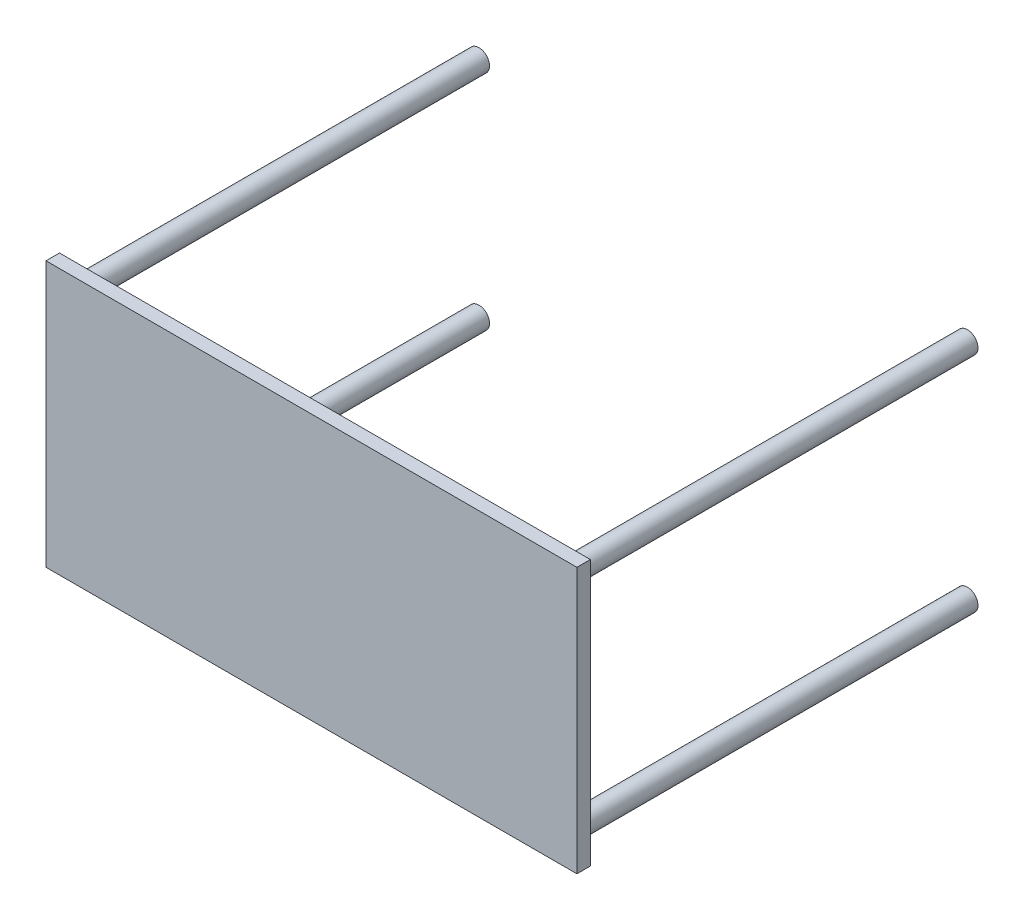
ISO-10303-21;
HEADER;
FILE_DESCRIPTION(('STEP AP214'),'2;1');
FILE_NAME('part.step','',(''),(''),'','','');
FILE_SCHEMA(('AUTOMOTIVE_DESIGN { 1 0 10303 214 1 1 1 1 }'));
ENDSEC;
DATA;
#1=APPLICATION_CONTEXT('core data for automotive mechanical design processes');
#2=APPLICATION_PROTOCOL_DEFINITION('international standard','automotive_design',2000,#1);
#3=PRODUCT_CONTEXT('',#1,'mechanical');
#4=PRODUCT('Part','Part','',(#3));
#5=PRODUCT_RELATED_PRODUCT_CATEGORY('part','',(#4));
#6=PRODUCT_DEFINITION_FORMATION('','',#4);
#7=PRODUCT_DEFINITION_CONTEXT('part definition',#1,'design');
#8=PRODUCT_DEFINITION('design','',#6,#7);
#9=PRODUCT_DEFINITION_SHAPE('','',#8);
#10=(LENGTH_UNIT() NAMED_UNIT(*) SI_UNIT(.MILLI.,.METRE.));
#11=(NAMED_UNIT(*) PLANE_ANGLE_UNIT() SI_UNIT($,.RADIAN.));
#12=(NAMED_UNIT(*) SI_UNIT($,.STERADIAN.) SOLID_ANGLE_UNIT());
#13=UNCERTAINTY_MEASURE_WITH_UNIT(LENGTH_MEASURE(1.E-05),#10,'distance_accuracy_value','');
#14=(GEOMETRIC_REPRESENTATION_CONTEXT(3) GLOBAL_UNCERTAINTY_ASSIGNED_CONTEXT((#13)) GLOBAL_UNIT_ASSIGNED_CONTEXT((#10,
#11,#12)) REPRESENTATION_CONTEXT('',''));
#15=CARTESIAN_POINT('',(0.,0.,0.));
#16=DIRECTION('',(0.,0.,1.));
#17=DIRECTION('',(1.,0.,0.));
#18=AXIS2_PLACEMENT_3D('',#15,#16,#17);
#19=CARTESIAN_POINT('',(500.,-250.,25.4));
#20=DIRECTION('',(-1.,0.,0.));
#21=DIRECTION('',(0.,0.,1.));
#22=AXIS2_PLACEMENT_3D('',#19,#20,#21);
#23=PLANE('',#22);
#24=DIRECTION('',(0.,1.,0.));
#25=VECTOR('',#24,1.);
#26=CARTESIAN_POINT('',(500.,-250.,0.));
#27=LINE('',#26,#25);
#28=CARTESIAN_POINT('',(500.,-250.,0.));
#29=VERTEX_POINT('',#28);
#30=CARTESIAN_POINT('',(500.,250.,0.));
#31=VERTEX_POINT('',#30);
#32=EDGE_CURVE('E111',#29,#31,#27,.T.);
#33=ORIENTED_EDGE('',*,*,#32,.T.);
#34=DIRECTION('',(0.,0.,-1.));
#35=VECTOR('',#34,1.);
#36=CARTESIAN_POINT('',(500.,250.,25.4));
#37=LINE('',#36,#35);
#38=CARTESIAN_POINT('',(500.,250.,25.4));
#39=VERTEX_POINT('',#38);
#40=EDGE_CURVE('E100',#39,#31,#37,.T.);
#41=ORIENTED_EDGE('',*,*,#40,.F.);
#42=DIRECTION('',(0.,1.,0.));
#43=VECTOR('',#42,1.);
#44=CARTESIAN_POINT('',(500.,-250.,25.4));
#45=LINE('',#44,#43);
#46=CARTESIAN_POINT('',(500.,-250.,25.4));
#47=VERTEX_POINT('',#46);
#48=EDGE_CURVE('E92',#47,#39,#45,.T.);
#49=ORIENTED_EDGE('',*,*,#48,.F.);
#50=DIRECTION('',(0.,0.,-1.));
#51=VECTOR('',#50,1.);
#52=CARTESIAN_POINT('',(500.,-250.,25.4));
#53=LINE('',#52,#51);
#54=EDGE_CURVE('E107',#47,#29,#53,.T.);
#55=ORIENTED_EDGE('',*,*,#54,.T.);
#56=EDGE_LOOP('',(#33,#41,#49,#55));
#57=FACE_BOUND('',#56,.T.);
#58=ADVANCED_FACE('F39',(#57),#23,.F.);
#59=CARTESIAN_POINT('',(-500.,250.,25.4));
#60=DIRECTION('',(0.,-1.,0.));
#61=DIRECTION('',(0.,0.,-1.));
#62=AXIS2_PLACEMENT_3D('',#59,#60,#61);
#63=PLANE('',#62);
#64=DIRECTION('',(-1.,0.,0.));
#65=VECTOR('',#64,1.);
#66=CARTESIAN_POINT('',(-500.,250.,0.));
#67=LINE('',#66,#65);
#68=CARTESIAN_POINT('',(-500.,250.,0.));
#69=VERTEX_POINT('',#68);
#70=EDGE_CURVE('E98',#31,#69,#67,.T.);
#71=ORIENTED_EDGE('',*,*,#70,.T.);
#72=DIRECTION('',(0.,0.,-1.));
#73=VECTOR('',#72,1.);
#74=CARTESIAN_POINT('',(-500.,250.,25.4));
#75=LINE('',#74,#73);
#76=CARTESIAN_POINT('',(-500.,250.,25.4));
#77=VERTEX_POINT('',#76);
#78=EDGE_CURVE('E96',#77,#69,#75,.T.);
#79=ORIENTED_EDGE('',*,*,#78,.F.);
#80=DIRECTION('',(-1.,0.,0.));
#81=VECTOR('',#80,1.);
#82=CARTESIAN_POINT('',(-500.,250.,25.4));
#83=LINE('',#82,#81);
#84=EDGE_CURVE('E87',#39,#77,#83,.T.);
#85=ORIENTED_EDGE('',*,*,#84,.F.);
#86=ORIENTED_EDGE('',*,*,#40,.T.);
#87=EDGE_LOOP('',(#71,#79,#85,#86));
#88=FACE_BOUND('',#87,.T.);
#89=ADVANCED_FACE('F97',(#88),#63,.F.);
#90=CARTESIAN_POINT('',(-500.,-250.,25.4));
#91=DIRECTION('',(1.,0.,0.));
#92=DIRECTION('',(0.,0.,-1.));
#93=AXIS2_PLACEMENT_3D('',#90,#91,#92);
#94=PLANE('',#93);
#95=DIRECTION('',(0.,-1.,0.));
#96=VECTOR('',#95,1.);
#97=CARTESIAN_POINT('',(-500.,-250.,0.));
#98=LINE('',#97,#96);
#99=CARTESIAN_POINT('',(-500.,-250.,0.));
#100=VERTEX_POINT('',#99);
#101=EDGE_CURVE('E73',#69,#100,#98,.T.);
#102=ORIENTED_EDGE('',*,*,#101,.T.);
#103=DIRECTION('',(0.,0.,-1.));
#104=VECTOR('',#103,1.);
#105=CARTESIAN_POINT('',(-500.,-250.,25.4));
#106=LINE('',#105,#104);
#107=CARTESIAN_POINT('',(-500.,-250.,25.4));
#108=VERTEX_POINT('',#107);
#109=EDGE_CURVE('E101',#108,#100,#106,.T.);
#110=ORIENTED_EDGE('',*,*,#109,.F.);
#111=DIRECTION('',(0.,-1.,0.));
#112=VECTOR('',#111,1.);
#113=CARTESIAN_POINT('',(-500.,-250.,25.4));
#114=LINE('',#113,#112);
#115=EDGE_CURVE('E90',#77,#108,#114,.T.);
#116=ORIENTED_EDGE('',*,*,#115,.F.);
#117=ORIENTED_EDGE('',*,*,#78,.T.);
#118=EDGE_LOOP('',(#102,#110,#116,#117));
#119=FACE_BOUND('',#118,.T.);
#120=ADVANCED_FACE('F103',(#119),#94,.F.);
#121=CARTESIAN_POINT('',(-500.,-250.,25.4));
#122=DIRECTION('',(0.,1.,0.));
#123=DIRECTION('',(0.,0.,1.));
#124=AXIS2_PLACEMENT_3D('',#121,#122,#123);
#125=PLANE('',#124);
#126=DIRECTION('',(1.,0.,0.));
#127=VECTOR('',#126,1.);
#128=CARTESIAN_POINT('',(-500.,-250.,0.));
#129=LINE('',#128,#127);
#130=EDGE_CURVE('E79',#100,#29,#129,.T.);
#131=ORIENTED_EDGE('',*,*,#130,.T.);
#132=ORIENTED_EDGE('',*,*,#54,.F.);
#133=DIRECTION('',(1.,0.,0.));
#134=VECTOR('',#133,1.);
#135=CARTESIAN_POINT('',(-500.,-250.,25.4));
#136=LINE('',#135,#134);
#137=EDGE_CURVE('E56',#108,#47,#136,.T.);
#138=ORIENTED_EDGE('',*,*,#137,.F.);
#139=ORIENTED_EDGE('',*,*,#109,.T.);
#140=EDGE_LOOP('',(#131,#132,#138,#139));
#141=FACE_BOUND('',#140,.T.);
#142=ADVANCED_FACE('F153',(#141),#125,.F.);
#143=CARTESIAN_POINT('',(0.,0.,25.4));
#144=DIRECTION('',(0.,0.,-1.));
#145=DIRECTION('',(-1.,0.,0.));
#146=AXIS2_PLACEMENT_3D('',#143,#144,#145);
#147=PLANE('',#146);
#148=ORIENTED_EDGE('',*,*,#48,.T.);
#149=ORIENTED_EDGE('',*,*,#84,.T.);
#150=ORIENTED_EDGE('',*,*,#115,.T.);
#151=ORIENTED_EDGE('',*,*,#137,.T.);
#152=EDGE_LOOP('',(#148,#149,#150,#151));
#153=FACE_BOUND('',#152,.T.);
#154=ADVANCED_FACE('F88',(#153),#147,.F.);
#155=CARTESIAN_POINT('',(0.,0.,0.));
#156=DIRECTION('',(0.,0.,-1.));
#157=DIRECTION('',(-1.,0.,0.));
#158=AXIS2_PLACEMENT_3D('',#155,#156,#157);
#159=PLANE('',#158);
#160=CARTESIAN_POINT('',(-460.,210.,0.));
#161=DIRECTION('',(0.,0.,-1.));
#162=DIRECTION('',(-1.,0.,0.));
#163=AXIS2_PLACEMENT_3D('',#160,#161,#162);
#164=CIRCLE('',#163,20.);
#165=CARTESIAN_POINT('',(-480.,210.,0.));
#166=VERTEX_POINT('',#165);
#167=EDGE_CURVE('E11',#166,#166,#164,.T.);
#168=ORIENTED_EDGE('',*,*,#167,.F.);
#169=EDGE_LOOP('',(#168));
#170=FACE_BOUND('',#169,.T.);
#171=CARTESIAN_POINT('',(-460.,-210.,0.));
#172=DIRECTION('',(0.,0.,-1.));
#173=DIRECTION('',(-1.,0.,0.));
#174=AXIS2_PLACEMENT_3D('',#171,#172,#173);
#175=CIRCLE('',#174,20.);
#176=CARTESIAN_POINT('',(-480.,-210.,0.));
#177=VERTEX_POINT('',#176);
#178=EDGE_CURVE('E48',#177,#177,#175,.T.);
#179=ORIENTED_EDGE('',*,*,#178,.F.);
#180=EDGE_LOOP('',(#179));
#181=FACE_BOUND('',#180,.T.);
#182=CARTESIAN_POINT('',(460.,-210.,0.));
#183=DIRECTION('',(0.,0.,-1.));
#184=DIRECTION('',(-1.,0.,0.));
#185=AXIS2_PLACEMENT_3D('',#182,#183,#184);
#186=CIRCLE('',#185,20.);
#187=CARTESIAN_POINT('',(440.,-210.,0.));
#188=VERTEX_POINT('',#187);
#189=EDGE_CURVE('E132',#188,#188,#186,.T.);
#190=ORIENTED_EDGE('',*,*,#189,.F.);
#191=EDGE_LOOP('',(#190));
#192=FACE_BOUND('',#191,.T.);
#193=CARTESIAN_POINT('',(460.,210.,0.));
#194=DIRECTION('',(0.,0.,-1.));
#195=DIRECTION('',(-1.,0.,0.));
#196=AXIS2_PLACEMENT_3D('',#193,#194,#195);
#197=CIRCLE('',#196,20.);
#198=CARTESIAN_POINT('',(440.,210.,0.));
#199=VERTEX_POINT('',#198);
#200=EDGE_CURVE('E128',#199,#199,#197,.T.);
#201=ORIENTED_EDGE('',*,*,#200,.F.);
#202=EDGE_LOOP('',(#201));
#203=FACE_BOUND('',#202,.T.);
#204=ORIENTED_EDGE('',*,*,#32,.F.);
#205=ORIENTED_EDGE('',*,*,#130,.F.);
#206=ORIENTED_EDGE('',*,*,#101,.F.);
#207=ORIENTED_EDGE('',*,*,#70,.F.);
#208=EDGE_LOOP('',(#204,#205,#206,#207));
#209=FACE_BOUND('',#208,.T.);
#210=ADVANCED_FACE('F141',(#170,#181,#192,#203,#209),#159,.T.);
#211=CARTESIAN_POINT('',(460.,210.,-750.));
#212=DIRECTION('',(0.,0.,1.));
#213=DIRECTION('',(1.,0.,0.));
#214=AXIS2_PLACEMENT_3D('',#211,#212,#213);
#215=CYLINDRICAL_SURFACE('',#214,20.);
#216=CARTESIAN_POINT('',(460.,210.,-750.));
#217=DIRECTION('',(0.,0.,1.));
#218=DIRECTION('',(1.,0.,0.));
#219=AXIS2_PLACEMENT_3D('',#216,#217,#218);
#220=CIRCLE('',#219,20.);
#221=CARTESIAN_POINT('',(480.,210.,-750.));
#222=VERTEX_POINT('',#221);
#223=EDGE_CURVE('E115',#222,#222,#220,.T.);
#224=ORIENTED_EDGE('',*,*,#223,.T.);
#225=EDGE_LOOP('',(#224));
#226=FACE_BOUND('',#225,.T.);
#227=ORIENTED_EDGE('',*,*,#200,.T.);
#228=EDGE_LOOP('',(#227));
#229=FACE_BOUND('',#228,.T.);
#230=ADVANCED_FACE('F144',(#226,#229),#215,.T.);
#231=CARTESIAN_POINT('',(460.,210.,-750.));
#232=DIRECTION('',(0.,0.,1.));
#233=DIRECTION('',(1.,0.,0.));
#234=AXIS2_PLACEMENT_3D('',#231,#232,#233);
#235=PLANE('',#234);
#236=ORIENTED_EDGE('',*,*,#223,.F.);
#237=EDGE_LOOP('',(#236));
#238=FACE_BOUND('',#237,.T.);
#239=ADVANCED_FACE('F197',(#238),#235,.F.);
#240=CARTESIAN_POINT('',(460.,-210.,-750.));
#241=DIRECTION('',(0.,0.,1.));
#242=DIRECTION('',(1.,0.,0.));
#243=AXIS2_PLACEMENT_3D('',#240,#241,#242);
#244=CYLINDRICAL_SURFACE('',#243,20.);
#245=CARTESIAN_POINT('',(460.,-210.,-750.));
#246=DIRECTION('',(0.,0.,1.));
#247=DIRECTION('',(-1.,0.,0.));
#248=AXIS2_PLACEMENT_3D('',#245,#246,#247);
#249=CIRCLE('',#248,20.);
#250=CARTESIAN_POINT('',(440.,-210.,-750.));
#251=VERTEX_POINT('',#250);
#252=EDGE_CURVE('E278',#251,#251,#249,.T.);
#253=ORIENTED_EDGE('',*,*,#252,.T.);
#254=EDGE_LOOP('',(#253));
#255=FACE_BOUND('',#254,.T.);
#256=ORIENTED_EDGE('',*,*,#189,.T.);
#257=EDGE_LOOP('',(#256));
#258=FACE_BOUND('',#257,.T.);
#259=ADVANCED_FACE('F207',(#255,#258),#244,.T.);
#260=CARTESIAN_POINT('',(460.,-210.,-750.));
#261=DIRECTION('',(0.,0.,-1.));
#262=DIRECTION('',(-1.,0.,0.));
#263=AXIS2_PLACEMENT_3D('',#260,#261,#262);
#264=PLANE('',#263);
#265=ORIENTED_EDGE('',*,*,#252,.F.);
#266=EDGE_LOOP('',(#265));
#267=FACE_BOUND('',#266,.T.);
#268=ADVANCED_FACE('F217',(#267),#264,.T.);
#269=CARTESIAN_POINT('',(-460.,-210.,-750.));
#270=DIRECTION('',(0.,0.,1.));
#271=DIRECTION('',(1.,0.,0.));
#272=AXIS2_PLACEMENT_3D('',#269,#270,#271);
#273=CYLINDRICAL_SURFACE('',#272,20.);
#274=CARTESIAN_POINT('',(-460.,-210.,-750.));
#275=DIRECTION('',(0.,0.,1.));
#276=DIRECTION('',(1.,0.,0.));
#277=AXIS2_PLACEMENT_3D('',#274,#275,#276);
#278=CIRCLE('',#277,20.);
#279=CARTESIAN_POINT('',(-440.,-210.,-750.));
#280=VERTEX_POINT('',#279);
#281=EDGE_CURVE('E274',#280,#280,#278,.T.);
#282=ORIENTED_EDGE('',*,*,#281,.T.);
#283=EDGE_LOOP('',(#282));
#284=FACE_BOUND('',#283,.T.);
#285=ORIENTED_EDGE('',*,*,#178,.T.);
#286=EDGE_LOOP('',(#285));
#287=FACE_BOUND('',#286,.T.);
#288=ADVANCED_FACE('F139',(#284,#287),#273,.T.);
#289=CARTESIAN_POINT('',(-460.,-210.,-750.));
#290=DIRECTION('',(0.,0.,1.));
#291=DIRECTION('',(1.,0.,0.));
#292=AXIS2_PLACEMENT_3D('',#289,#290,#291);
#293=PLANE('',#292);
#294=ORIENTED_EDGE('',*,*,#281,.F.);
#295=EDGE_LOOP('',(#294));
#296=FACE_BOUND('',#295,.T.);
#297=ADVANCED_FACE('F236',(#296),#293,.F.);
#298=CARTESIAN_POINT('',(-460.,210.,-750.));
#299=DIRECTION('',(0.,0.,1.));
#300=DIRECTION('',(1.,0.,0.));
#301=AXIS2_PLACEMENT_3D('',#298,#299,#300);
#302=CYLINDRICAL_SURFACE('',#301,20.);
#303=CARTESIAN_POINT('',(-460.,210.,-750.));
#304=DIRECTION('',(0.,0.,1.));
#305=DIRECTION('',(-1.,0.,0.));
#306=AXIS2_PLACEMENT_3D('',#303,#304,#305);
#307=CIRCLE('',#306,20.);
#308=CARTESIAN_POINT('',(-480.,210.,-750.));
#309=VERTEX_POINT('',#308);
#310=EDGE_CURVE('E272',#309,#309,#307,.T.);
#311=ORIENTED_EDGE('',*,*,#310,.T.);
#312=EDGE_LOOP('',(#311));
#313=FACE_BOUND('',#312,.T.);
#314=ORIENTED_EDGE('',*,*,#167,.T.);
#315=EDGE_LOOP('',(#314));
#316=FACE_BOUND('',#315,.T.);
#317=ADVANCED_FACE('F246',(#313,#316),#302,.T.);
#318=CARTESIAN_POINT('',(-460.,210.,-750.));
#319=DIRECTION('',(0.,0.,-1.));
#320=DIRECTION('',(-1.,0.,0.));
#321=AXIS2_PLACEMENT_3D('',#318,#319,#320);
#322=PLANE('',#321);
#323=ORIENTED_EDGE('',*,*,#310,.F.);
#324=EDGE_LOOP('',(#323));
#325=FACE_BOUND('',#324,.T.);
#326=ADVANCED_FACE('F256',(#325),#322,.T.);
#327=CLOSED_SHELL('',(#58,#89,#120,#142,#154,#210,#230,#239,#259,#268,#288,#297,#317,#326));
#328=MANIFOLD_SOLID_BREP('B2',#327);
#329=ADVANCED_BREP_SHAPE_REPRESENTATION('',(#18,#328),#14);
#330=SHAPE_DEFINITION_REPRESENTATION(#9,#329);
ENDSEC;
END-ISO-10303-21;
